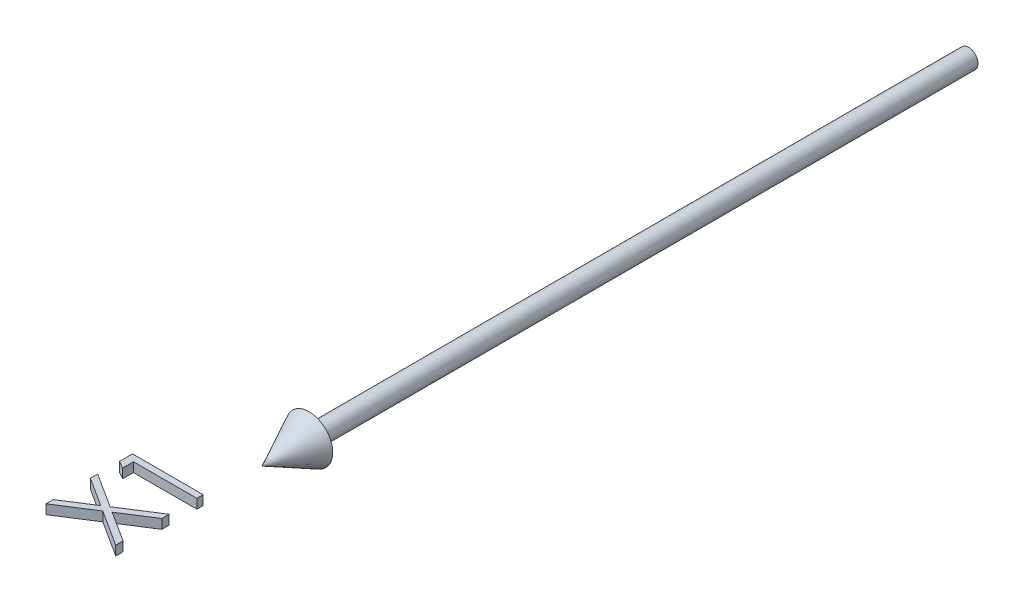
ISO-10303-21;
HEADER;
FILE_DESCRIPTION(('STEP AP214'),'2;1');
FILE_NAME('part.step','',(''),(''),'','','');
FILE_SCHEMA(('AUTOMOTIVE_DESIGN { 1 0 10303 214 1 1 1 1 }'));
ENDSEC;
DATA;
#1=APPLICATION_CONTEXT('core data for automotive mechanical design processes');
#2=APPLICATION_PROTOCOL_DEFINITION('international standard','automotive_design',2000,#1);
#3=PRODUCT_CONTEXT('',#1,'mechanical');
#4=PRODUCT('Part','Part','',(#3));
#5=PRODUCT_RELATED_PRODUCT_CATEGORY('part','',(#4));
#6=PRODUCT_DEFINITION_FORMATION('','',#4);
#7=PRODUCT_DEFINITION_CONTEXT('part definition',#1,'design');
#8=PRODUCT_DEFINITION('design','',#6,#7);
#9=PRODUCT_DEFINITION_SHAPE('','',#8);
#10=(LENGTH_UNIT() NAMED_UNIT(*) SI_UNIT(.MILLI.,.METRE.));
#11=(NAMED_UNIT(*) PLANE_ANGLE_UNIT() SI_UNIT($,.RADIAN.));
#12=(NAMED_UNIT(*) SI_UNIT($,.STERADIAN.) SOLID_ANGLE_UNIT());
#13=UNCERTAINTY_MEASURE_WITH_UNIT(LENGTH_MEASURE(1.E-05),#10,'distance_accuracy_value','');
#14=(GEOMETRIC_REPRESENTATION_CONTEXT(3) GLOBAL_UNCERTAINTY_ASSIGNED_CONTEXT((#13)) GLOBAL_UNIT_ASSIGNED_CONTEXT((#10,
#11,#12)) REPRESENTATION_CONTEXT('',''));
#15=CARTESIAN_POINT('',(0.,0.,0.));
#16=DIRECTION('',(0.,0.,1.));
#17=DIRECTION('',(1.,0.,0.));
#18=AXIS2_PLACEMENT_3D('',#15,#16,#17);
#19=CARTESIAN_POINT('',(-7.65024038461539,1.,176.159855769231));
#20=DIRECTION('',(0.539190475611023,0.,0.842183846324755));
#21=DIRECTION('',(0.842183846324755,0.,-0.539190475611023));
#22=AXIS2_PLACEMENT_3D('',#19,#20,#21);
#23=PLANE('',#22);
#24=DIRECTION('',(0.,-1.,0.));
#25=VECTOR('',#24,1.);
#26=CARTESIAN_POINT('',(-15.,1.,180.865384615385));
#27=LINE('',#26,#25);
#28=CARTESIAN_POINT('',(-15.,1.,180.865384615385));
#29=VERTEX_POINT('',#28);
#30=CARTESIAN_POINT('',(-15.,-1.,180.865384615385));
#31=VERTEX_POINT('',#30);
#32=EDGE_CURVE('E49',#29,#31,#27,.T.);
#33=ORIENTED_EDGE('',*,*,#32,.T.);
#34=DIRECTION('',(-0.842183846324755,0.,0.539190475611023));
#35=VECTOR('',#34,1.);
#36=CARTESIAN_POINT('',(-7.65024038461539,-1.,176.159855769231));
#37=LINE('',#36,#35);
#38=CARTESIAN_POINT('',(-7.65024038461539,-1.,176.159855769231));
#39=VERTEX_POINT('',#38);
#40=EDGE_CURVE('E134',#39,#31,#37,.T.);
#41=ORIENTED_EDGE('',*,*,#40,.F.);
#42=DIRECTION('',(0.,-1.,0.));
#43=VECTOR('',#42,1.);
#44=CARTESIAN_POINT('',(-7.65024038461539,1.,176.159855769231));
#45=LINE('',#44,#43);
#46=CARTESIAN_POINT('',(-7.65024038461539,1.,176.159855769231));
#47=VERTEX_POINT('',#46);
#48=EDGE_CURVE('E12',#47,#39,#45,.T.);
#49=ORIENTED_EDGE('',*,*,#48,.F.);
#50=DIRECTION('',(-0.842183846324755,0.,0.539190475611023));
#51=VECTOR('',#50,1.);
#52=CARTESIAN_POINT('',(-7.65024038461539,1.,176.159855769231));
#53=LINE('',#52,#51);
#54=EDGE_CURVE('E135',#47,#29,#53,.T.);
#55=ORIENTED_EDGE('',*,*,#54,.T.);
#56=EDGE_LOOP('',(#33,#41,#49,#55));
#57=FACE_BOUND('',#56,.T.);
#58=ADVANCED_FACE('F46',(#57),#23,.T.);
#59=CARTESIAN_POINT('',(0.,1.,181.057692307692));
#60=DIRECTION('',(-0.539185104098949,0.,0.842187285298113));
#61=DIRECTION('',(0.842187285298113,0.,0.539185104098949));
#62=AXIS2_PLACEMENT_3D('',#59,#60,#61);
#63=PLANE('',#62);
#64=ORIENTED_EDGE('',*,*,#48,.T.);
#65=DIRECTION('',(-0.842187285298113,0.,-0.539185104098949));
#66=VECTOR('',#65,1.);
#67=CARTESIAN_POINT('',(0.,-1.,181.057692307692));
#68=LINE('',#67,#66);
#69=CARTESIAN_POINT('',(0.,-1.,181.057692307692));
#70=VERTEX_POINT('',#69);
#71=EDGE_CURVE('E152',#70,#39,#68,.T.);
#72=ORIENTED_EDGE('',*,*,#71,.F.);
#73=DIRECTION('',(0.,-1.,0.));
#74=VECTOR('',#73,1.);
#75=CARTESIAN_POINT('',(0.,1.,181.057692307692));
#76=LINE('',#75,#74);
#77=CARTESIAN_POINT('',(0.,1.,181.057692307692));
#78=VERTEX_POINT('',#77);
#79=EDGE_CURVE('E54',#78,#70,#76,.T.);
#80=ORIENTED_EDGE('',*,*,#79,.F.);
#81=DIRECTION('',(-0.842187285298113,0.,-0.539185104098949));
#82=VECTOR('',#81,1.);
#83=CARTESIAN_POINT('',(0.,1.,181.057692307692));
#84=LINE('',#83,#82);
#85=EDGE_CURVE('E140',#78,#47,#84,.T.);
#86=ORIENTED_EDGE('',*,*,#85,.T.);
#87=EDGE_LOOP('',(#64,#72,#80,#86));
#88=FACE_BOUND('',#87,.T.);
#89=ADVANCED_FACE('F264',(#88),#63,.T.);
#90=CARTESIAN_POINT('',(0.,1.,179.504206730769));
#91=DIRECTION('',(1.,0.,0.));
#92=DIRECTION('',(0.,0.,-1.));
#93=AXIS2_PLACEMENT_3D('',#90,#91,#92);
#94=PLANE('',#93);
#95=ORIENTED_EDGE('',*,*,#79,.T.);
#96=DIRECTION('',(0.,0.,1.));
#97=VECTOR('',#96,1.);
#98=CARTESIAN_POINT('',(0.,-1.,179.504206730769));
#99=LINE('',#98,#97);
#100=CARTESIAN_POINT('',(0.,-1.,179.504206730769));
#101=VERTEX_POINT('',#100);
#102=EDGE_CURVE('E177',#101,#70,#99,.T.);
#103=ORIENTED_EDGE('',*,*,#102,.F.);
#104=DIRECTION('',(0.,-1.,0.));
#105=VECTOR('',#104,1.);
#106=CARTESIAN_POINT('',(0.,1.,179.504206730769));
#107=LINE('',#106,#105);
#108=CARTESIAN_POINT('',(0.,1.,179.504206730769));
#109=VERTEX_POINT('',#108);
#110=EDGE_CURVE('E211',#109,#101,#107,.T.);
#111=ORIENTED_EDGE('',*,*,#110,.F.);
#112=DIRECTION('',(0.,0.,1.));
#113=VECTOR('',#112,1.);
#114=CARTESIAN_POINT('',(0.,1.,179.504206730769));
#115=LINE('',#114,#113);
#116=EDGE_CURVE('E207',#109,#78,#115,.T.);
#117=ORIENTED_EDGE('',*,*,#116,.T.);
#118=EDGE_LOOP('',(#95,#103,#111,#117));
#119=FACE_BOUND('',#118,.T.);
#120=ADVANCED_FACE('F262',(#119),#94,.T.);
#121=CARTESIAN_POINT('',(-6.43629807692308,1.,175.384615384615));
#122=DIRECTION('',(0.539087169942496,0.,-0.842249976671648));
#123=DIRECTION('',(-0.842249976671648,0.,-0.539087169942496));
#124=AXIS2_PLACEMENT_3D('',#121,#122,#123);
#125=PLANE('',#124);
#126=ORIENTED_EDGE('',*,*,#110,.T.);
#127=DIRECTION('',(0.842249976671648,0.,0.539087169942496));
#128=VECTOR('',#127,1.);
#129=CARTESIAN_POINT('',(-6.43629807692308,-1.,175.384615384615));
#130=LINE('',#129,#128);
#131=CARTESIAN_POINT('',(-6.43629807692308,-1.,175.384615384615));
#132=VERTEX_POINT('',#131);
#133=EDGE_CURVE('E174',#132,#101,#130,.T.);
#134=ORIENTED_EDGE('',*,*,#133,.F.);
#135=DIRECTION('',(0.,-1.,0.));
#136=VECTOR('',#135,1.);
#137=CARTESIAN_POINT('',(-6.43629807692308,1.,175.384615384615));
#138=LINE('',#137,#136);
#139=CARTESIAN_POINT('',(-6.43629807692308,1.,175.384615384615));
#140=VERTEX_POINT('',#139);
#141=EDGE_CURVE('E213',#140,#132,#138,.T.);
#142=ORIENTED_EDGE('',*,*,#141,.F.);
#143=DIRECTION('',(0.842249976671648,0.,0.539087169942496));
#144=VECTOR('',#143,1.);
#145=CARTESIAN_POINT('',(-6.43629807692308,1.,175.384615384615));
#146=LINE('',#145,#144);
#147=EDGE_CURVE('E204',#140,#109,#146,.T.);
#148=ORIENTED_EDGE('',*,*,#147,.T.);
#149=EDGE_LOOP('',(#126,#134,#142,#148));
#150=FACE_BOUND('',#149,.T.);
#151=ADVANCED_FACE('F260',(#150),#125,.T.);
#152=CARTESIAN_POINT('',(0.,1.,171.265024038462));
#153=DIRECTION('',(0.539087169942498,0.,0.842249976671646));
#154=DIRECTION('',(0.842249976671646,0.,-0.539087169942498));
#155=AXIS2_PLACEMENT_3D('',#152,#153,#154);
#156=PLANE('',#155);
#157=ORIENTED_EDGE('',*,*,#141,.T.);
#158=DIRECTION('',(-0.842249976671646,0.,0.539087169942498));
#159=VECTOR('',#158,1.);
#160=CARTESIAN_POINT('',(0.,-1.,171.265024038462));
#161=LINE('',#160,#159);
#162=CARTESIAN_POINT('',(0.,-1.,171.265024038462));
#163=VERTEX_POINT('',#162);
#164=EDGE_CURVE('E171',#163,#132,#161,.T.);
#165=ORIENTED_EDGE('',*,*,#164,.F.);
#166=DIRECTION('',(0.,-1.,0.));
#167=VECTOR('',#166,1.);
#168=CARTESIAN_POINT('',(0.,1.,171.265024038462));
#169=LINE('',#168,#167);
#170=CARTESIAN_POINT('',(0.,1.,171.265024038462));
#171=VERTEX_POINT('',#170);
#172=EDGE_CURVE('E215',#171,#163,#169,.T.);
#173=ORIENTED_EDGE('',*,*,#172,.F.);
#174=DIRECTION('',(-0.842249976671646,0.,0.539087169942498));
#175=VECTOR('',#174,1.);
#176=CARTESIAN_POINT('',(0.,1.,171.265024038462));
#177=LINE('',#176,#175);
#178=EDGE_CURVE('E201',#171,#140,#177,.T.);
#179=ORIENTED_EDGE('',*,*,#178,.T.);
#180=EDGE_LOOP('',(#157,#165,#173,#179));
#181=FACE_BOUND('',#180,.T.);
#182=ADVANCED_FACE('F255',(#181),#156,.T.);
#183=CARTESIAN_POINT('',(0.,1.,169.711538461538));
#184=DIRECTION('',(1.,0.,0.));
#185=DIRECTION('',(0.,0.,-1.));
#186=AXIS2_PLACEMENT_3D('',#183,#184,#185);
#187=PLANE('',#186);
#188=ORIENTED_EDGE('',*,*,#172,.T.);
#189=DIRECTION('',(0.,0.,1.));
#190=VECTOR('',#189,1.);
#191=CARTESIAN_POINT('',(0.,-1.,169.711538461538));
#192=LINE('',#191,#190);
#193=CARTESIAN_POINT('',(0.,-1.,169.711538461538));
#194=VERTEX_POINT('',#193);
#195=EDGE_CURVE('E168',#194,#163,#192,.T.);
#196=ORIENTED_EDGE('',*,*,#195,.F.);
#197=DIRECTION('',(0.,-1.,0.));
#198=VECTOR('',#197,1.);
#199=CARTESIAN_POINT('',(0.,1.,169.711538461538));
#200=LINE('',#199,#198);
#201=CARTESIAN_POINT('',(0.,1.,169.711538461538));
#202=VERTEX_POINT('',#201);
#203=EDGE_CURVE('E217',#202,#194,#200,.T.);
#204=ORIENTED_EDGE('',*,*,#203,.F.);
#205=DIRECTION('',(0.,0.,1.));
#206=VECTOR('',#205,1.);
#207=CARTESIAN_POINT('',(0.,1.,169.711538461538));
#208=LINE('',#207,#206);
#209=EDGE_CURVE('E198',#202,#171,#208,.T.);
#210=ORIENTED_EDGE('',*,*,#209,.T.);
#211=EDGE_LOOP('',(#188,#196,#204,#210));
#212=FACE_BOUND('',#211,.T.);
#213=ADVANCED_FACE('F250',(#212),#187,.T.);
#214=CARTESIAN_POINT('',(-7.65024038461539,1.,174.606370192308));
#215=DIRECTION('',(-0.538950419912938,0.,-0.842337488703707));
#216=DIRECTION('',(-0.842337488703707,0.,0.538950419912938));
#217=AXIS2_PLACEMENT_3D('',#214,#215,#216);
#218=PLANE('',#217);
#219=ORIENTED_EDGE('',*,*,#203,.T.);
#220=DIRECTION('',(0.842337488703707,0.,-0.538950419912938));
#221=VECTOR('',#220,1.);
#222=CARTESIAN_POINT('',(-7.65024038461539,-1.,174.606370192308));
#223=LINE('',#222,#221);
#224=CARTESIAN_POINT('',(-7.65024038461539,-1.,174.606370192308));
#225=VERTEX_POINT('',#224);
#226=EDGE_CURVE('E165',#225,#194,#223,.T.);
#227=ORIENTED_EDGE('',*,*,#226,.F.);
#228=DIRECTION('',(0.,-1.,0.));
#229=VECTOR('',#228,1.);
#230=CARTESIAN_POINT('',(-7.65024038461539,1.,174.606370192308));
#231=LINE('',#230,#229);
#232=CARTESIAN_POINT('',(-7.65024038461539,1.,174.606370192308));
#233=VERTEX_POINT('',#232);
#234=EDGE_CURVE('E219',#233,#225,#231,.T.);
#235=ORIENTED_EDGE('',*,*,#234,.F.);
#236=DIRECTION('',(0.842337488703707,0.,-0.538950419912938));
#237=VECTOR('',#236,1.);
#238=CARTESIAN_POINT('',(-7.65024038461539,1.,174.606370192308));
#239=LINE('',#238,#237);
#240=EDGE_CURVE('E195',#233,#202,#239,.T.);
#241=ORIENTED_EDGE('',*,*,#240,.T.);
#242=EDGE_LOOP('',(#219,#227,#235,#241));
#243=FACE_BOUND('',#242,.T.);
#244=ADVANCED_FACE('F248',(#243),#218,.T.);
#245=CARTESIAN_POINT('',(-15.,1.,169.903846153846));
#246=DIRECTION('',(0.538946197134425,0.,-0.842340190537257));
#247=DIRECTION('',(-0.842340190537257,0.,-0.538946197134425));
#248=AXIS2_PLACEMENT_3D('',#245,#246,#247);
#249=PLANE('',#248);
#250=ORIENTED_EDGE('',*,*,#234,.T.);
#251=DIRECTION('',(0.842340190537257,0.,0.538946197134425));
#252=VECTOR('',#251,1.);
#253=CARTESIAN_POINT('',(-15.,-1.,169.903846153846));
#254=LINE('',#253,#252);
#255=CARTESIAN_POINT('',(-15.,-1.,169.903846153846));
#256=VERTEX_POINT('',#255);
#257=EDGE_CURVE('E162',#256,#225,#254,.T.);
#258=ORIENTED_EDGE('',*,*,#257,.F.);
#259=DIRECTION('',(0.,-1.,0.));
#260=VECTOR('',#259,1.);
#261=CARTESIAN_POINT('',(-15.,1.,169.903846153846));
#262=LINE('',#261,#260);
#263=CARTESIAN_POINT('',(-15.,1.,169.903846153846));
#264=VERTEX_POINT('',#263);
#265=EDGE_CURVE('E221',#264,#256,#262,.T.);
#266=ORIENTED_EDGE('',*,*,#265,.F.);
#267=DIRECTION('',(0.842340190537257,0.,0.538946197134425));
#268=VECTOR('',#267,1.);
#269=CARTESIAN_POINT('',(-15.,1.,169.903846153846));
#270=LINE('',#269,#268);
#271=EDGE_CURVE('E192',#264,#233,#270,.T.);
#272=ORIENTED_EDGE('',*,*,#271,.T.);
#273=EDGE_LOOP('',(#250,#258,#266,#272));
#274=FACE_BOUND('',#273,.T.);
#275=ADVANCED_FACE('F243',(#274),#249,.T.);
#276=CARTESIAN_POINT('',(-15.,1.,171.457331730769));
#277=DIRECTION('',(-1.,0.,0.));
#278=DIRECTION('',(0.,0.,1.));
#279=AXIS2_PLACEMENT_3D('',#276,#277,#278);
#280=PLANE('',#279);
#281=ORIENTED_EDGE('',*,*,#265,.T.);
#282=DIRECTION('',(0.,0.,-1.));
#283=VECTOR('',#282,1.);
#284=CARTESIAN_POINT('',(-15.,-1.,171.457331730769));
#285=LINE('',#284,#283);
#286=CARTESIAN_POINT('',(-15.,-1.,171.457331730769));
#287=VERTEX_POINT('',#286);
#288=EDGE_CURVE('E159',#287,#256,#285,.T.);
#289=ORIENTED_EDGE('',*,*,#288,.F.);
#290=DIRECTION('',(0.,-1.,0.));
#291=VECTOR('',#290,1.);
#292=CARTESIAN_POINT('',(-15.,1.,171.457331730769));
#293=LINE('',#292,#291);
#294=CARTESIAN_POINT('',(-15.,1.,171.457331730769));
#295=VERTEX_POINT('',#294);
#296=EDGE_CURVE('E223',#295,#287,#293,.T.);
#297=ORIENTED_EDGE('',*,*,#296,.F.);
#298=DIRECTION('',(0.,0.,-1.));
#299=VECTOR('',#298,1.);
#300=CARTESIAN_POINT('',(-15.,1.,171.457331730769));
#301=LINE('',#300,#299);
#302=EDGE_CURVE('E189',#295,#264,#301,.T.);
#303=ORIENTED_EDGE('',*,*,#302,.T.);
#304=EDGE_LOOP('',(#281,#289,#297,#303));
#305=FACE_BOUND('',#304,.T.);
#306=ADVANCED_FACE('F236',(#305),#280,.T.);
#307=CARTESIAN_POINT('',(-8.86418269230769,1.,175.384615384615));
#308=DIRECTION('',(-0.539088809128563,0.,0.842248927498485));
#309=DIRECTION('',(0.842248927498485,0.,0.539088809128563));
#310=AXIS2_PLACEMENT_3D('',#307,#308,#309);
#311=PLANE('',#310);
#312=ORIENTED_EDGE('',*,*,#296,.T.);
#313=DIRECTION('',(-0.842248927498485,0.,-0.539088809128563));
#314=VECTOR('',#313,1.);
#315=CARTESIAN_POINT('',(-8.86418269230769,-1.,175.384615384615));
#316=LINE('',#315,#314);
#317=CARTESIAN_POINT('',(-8.86418269230769,-1.,175.384615384615));
#318=VERTEX_POINT('',#317);
#319=EDGE_CURVE('E156',#318,#287,#316,.T.);
#320=ORIENTED_EDGE('',*,*,#319,.F.);
#321=DIRECTION('',(0.,-1.,0.));
#322=VECTOR('',#321,1.);
#323=CARTESIAN_POINT('',(-8.86418269230769,1.,175.384615384615));
#324=LINE('',#323,#322);
#325=CARTESIAN_POINT('',(-8.86418269230769,1.,175.384615384615));
#326=VERTEX_POINT('',#325);
#327=EDGE_CURVE('E225',#326,#318,#324,.T.);
#328=ORIENTED_EDGE('',*,*,#327,.F.);
#329=DIRECTION('',(-0.842248927498485,0.,-0.539088809128563));
#330=VECTOR('',#329,1.);
#331=CARTESIAN_POINT('',(-8.86418269230769,1.,175.384615384615));
#332=LINE('',#331,#330);
#333=EDGE_CURVE('E186',#326,#295,#332,.T.);
#334=ORIENTED_EDGE('',*,*,#333,.T.);
#335=EDGE_LOOP('',(#312,#320,#328,#334));
#336=FACE_BOUND('',#335,.T.);
#337=ADVANCED_FACE('F233',(#336),#311,.T.);
#338=CARTESIAN_POINT('',(-15.,1.,179.311899038462));
#339=DIRECTION('',(-0.53908880912856,0.,-0.842248927498487));
#340=DIRECTION('',(-0.842248927498487,0.,0.53908880912856));
#341=AXIS2_PLACEMENT_3D('',#338,#339,#340);
#342=PLANE('',#341);
#343=ORIENTED_EDGE('',*,*,#327,.T.);
#344=DIRECTION('',(0.842248927498486,0.,-0.53908880912856));
#345=VECTOR('',#344,1.);
#346=CARTESIAN_POINT('',(-15.,-1.,179.311899038462));
#347=LINE('',#346,#345);
#348=CARTESIAN_POINT('',(-15.,-1.,179.311899038462));
#349=VERTEX_POINT('',#348);
#350=EDGE_CURVE('E147',#349,#318,#347,.T.);
#351=ORIENTED_EDGE('',*,*,#350,.F.);
#352=DIRECTION('',(0.,-1.,0.));
#353=VECTOR('',#352,1.);
#354=CARTESIAN_POINT('',(-15.,1.,179.311899038462));
#355=LINE('',#354,#353);
#356=CARTESIAN_POINT('',(-15.,1.,179.311899038462));
#357=VERTEX_POINT('',#356);
#358=EDGE_CURVE('E139',#357,#349,#355,.T.);
#359=ORIENTED_EDGE('',*,*,#358,.F.);
#360=DIRECTION('',(0.842248927498486,0.,-0.53908880912856));
#361=VECTOR('',#360,1.);
#362=CARTESIAN_POINT('',(-15.,1.,179.311899038462));
#363=LINE('',#362,#361);
#364=EDGE_CURVE('E183',#357,#326,#363,.T.);
#365=ORIENTED_EDGE('',*,*,#364,.T.);
#366=EDGE_LOOP('',(#343,#351,#359,#365));
#367=FACE_BOUND('',#366,.T.);
#368=ADVANCED_FACE('F227',(#367),#342,.T.);
#369=CARTESIAN_POINT('',(-15.,1.,180.865384615385));
#370=DIRECTION('',(-1.,0.,0.));
#371=DIRECTION('',(0.,0.,1.));
#372=AXIS2_PLACEMENT_3D('',#369,#370,#371);
#373=PLANE('',#372);
#374=ORIENTED_EDGE('',*,*,#358,.T.);
#375=DIRECTION('',(0.,0.,-1.));
#376=VECTOR('',#375,1.);
#377=CARTESIAN_POINT('',(-15.,-1.,180.865384615385));
#378=LINE('',#377,#376);
#379=EDGE_CURVE('E142',#31,#349,#378,.T.);
#380=ORIENTED_EDGE('',*,*,#379,.F.);
#381=ORIENTED_EDGE('',*,*,#32,.F.);
#382=DIRECTION('',(0.,0.,-1.));
#383=VECTOR('',#382,1.);
#384=CARTESIAN_POINT('',(-15.,1.,180.865384615385));
#385=LINE('',#384,#383);
#386=EDGE_CURVE('E181',#29,#357,#385,.T.);
#387=ORIENTED_EDGE('',*,*,#386,.T.);
#388=EDGE_LOOP('',(#374,#380,#381,#387));
#389=FACE_BOUND('',#388,.T.);
#390=ADVANCED_FACE('F143',(#389),#373,.T.);
#391=CARTESIAN_POINT('',(0.,1.,0.));
#392=DIRECTION('',(0.,-1.,0.));
#393=DIRECTION('',(0.,0.,-1.));
#394=AXIS2_PLACEMENT_3D('',#391,#392,#393);
#395=PLANE('',#394);
#396=ORIENTED_EDGE('',*,*,#54,.F.);
#397=ORIENTED_EDGE('',*,*,#85,.F.);
#398=ORIENTED_EDGE('',*,*,#116,.F.);
#399=ORIENTED_EDGE('',*,*,#147,.F.);
#400=ORIENTED_EDGE('',*,*,#178,.F.);
#401=ORIENTED_EDGE('',*,*,#209,.F.);
#402=ORIENTED_EDGE('',*,*,#240,.F.);
#403=ORIENTED_EDGE('',*,*,#271,.F.);
#404=ORIENTED_EDGE('',*,*,#302,.F.);
#405=ORIENTED_EDGE('',*,*,#333,.F.);
#406=ORIENTED_EDGE('',*,*,#364,.F.);
#407=ORIENTED_EDGE('',*,*,#386,.F.);
#408=EDGE_LOOP('',(#396,#397,#398,#399,#400,#401,#402,#403,#404,#405,#406,#407));
#409=FACE_BOUND('',#408,.T.);
#410=ADVANCED_FACE('F239',(#409),#395,.F.);
#411=CARTESIAN_POINT('',(0.,-1.,0.));
#412=DIRECTION('',(0.,-1.,0.));
#413=DIRECTION('',(0.,0.,-1.));
#414=AXIS2_PLACEMENT_3D('',#411,#412,#413);
#415=PLANE('',#414);
#416=ORIENTED_EDGE('',*,*,#40,.T.);
#417=ORIENTED_EDGE('',*,*,#379,.T.);
#418=ORIENTED_EDGE('',*,*,#350,.T.);
#419=ORIENTED_EDGE('',*,*,#319,.T.);
#420=ORIENTED_EDGE('',*,*,#288,.T.);
#421=ORIENTED_EDGE('',*,*,#257,.T.);
#422=ORIENTED_EDGE('',*,*,#226,.T.);
#423=ORIENTED_EDGE('',*,*,#195,.T.);
#424=ORIENTED_EDGE('',*,*,#164,.T.);
#425=ORIENTED_EDGE('',*,*,#133,.T.);
#426=ORIENTED_EDGE('',*,*,#102,.T.);
#427=ORIENTED_EDGE('',*,*,#71,.T.);
#428=EDGE_LOOP('',(#416,#417,#418,#419,#420,#421,#422,#423,#424,#425,#426,#427));
#429=FACE_BOUND('',#428,.T.);
#430=ADVANCED_FACE('F150',(#429),#415,.T.);
#431=CLOSED_SHELL('',(#58,#89,#120,#151,#182,#213,#244,#275,#306,#337,#368,#390,#410,#430));
#432=MANIFOLD_SOLID_BREP('B2',#431);
#433=CARTESIAN_POINT('',(-13.4615384615385,1.,166.153846153846));
#434=DIRECTION('',(-0.496686511837692,0.,0.867930013859704));
#435=DIRECTION('',(0.867930013859704,0.,0.496686511837692));
#436=AXIS2_PLACEMENT_3D('',#433,#434,#435);
#437=PLANE('',#436);
#438=DIRECTION('',(0.,-1.,0.));
#439=VECTOR('',#438,1.);
#440=CARTESIAN_POINT('',(-15.,1.,165.2734375));
#441=LINE('',#440,#439);
#442=CARTESIAN_POINT('',(-15.,1.,165.2734375));
#443=VERTEX_POINT('',#442);
#444=CARTESIAN_POINT('',(-15.,-1.,165.2734375));
#445=VERTEX_POINT('',#444);
#446=EDGE_CURVE('E396',#443,#445,#441,.T.);
#447=ORIENTED_EDGE('',*,*,#446,.T.);
#448=DIRECTION('',(-0.867930013859704,0.,-0.496686511837692));
#449=VECTOR('',#448,1.);
#450=CARTESIAN_POINT('',(-13.4615384615385,-1.,166.153846153846));
#451=LINE('',#450,#449);
#452=CARTESIAN_POINT('',(-13.4615384615385,-1.,166.153846153846));
#453=VERTEX_POINT('',#452);
#454=EDGE_CURVE('E445',#453,#445,#451,.T.);
#455=ORIENTED_EDGE('',*,*,#454,.F.);
#456=DIRECTION('',(0.,-1.,0.));
#457=VECTOR('',#456,1.);
#458=CARTESIAN_POINT('',(-13.4615384615385,1.,166.153846153846));
#459=LINE('',#458,#457);
#460=CARTESIAN_POINT('',(-13.4615384615385,1.,166.153846153846));
#461=VERTEX_POINT('',#460);
#462=EDGE_CURVE('E44',#461,#453,#459,.T.);
#463=ORIENTED_EDGE('',*,*,#462,.F.);
#464=DIRECTION('',(-0.867930013859704,0.,-0.496686511837692));
#465=VECTOR('',#464,1.);
#466=CARTESIAN_POINT('',(-13.4615384615385,1.,166.153846153846));
#467=LINE('',#466,#465);
#468=EDGE_CURVE('E446',#461,#443,#467,.T.);
#469=ORIENTED_EDGE('',*,*,#468,.T.);
#470=EDGE_LOOP('',(#447,#455,#463,#469));
#471=FACE_BOUND('',#470,.T.);
#472=ADVANCED_FACE('F393',(#471),#437,.T.);
#473=CARTESIAN_POINT('',(-13.4615384615385,1.,163.846153846154));
#474=DIRECTION('',(1.,0.,0.));
#475=DIRECTION('',(0.,0.,-1.));
#476=AXIS2_PLACEMENT_3D('',#473,#474,#475);
#477=PLANE('',#476);
#478=ORIENTED_EDGE('',*,*,#462,.T.);
#479=DIRECTION('',(0.,0.,1.));
#480=VECTOR('',#479,1.);
#481=CARTESIAN_POINT('',(-13.4615384615385,-1.,163.846153846154));
#482=LINE('',#481,#480);
#483=CARTESIAN_POINT('',(-13.4615384615385,-1.,163.846153846154));
#484=VERTEX_POINT('',#483);
#485=EDGE_CURVE('E463',#484,#453,#482,.T.);
#486=ORIENTED_EDGE('',*,*,#485,.F.);
#487=DIRECTION('',(0.,-1.,0.));
#488=VECTOR('',#487,1.);
#489=CARTESIAN_POINT('',(-13.4615384615385,1.,163.846153846154));
#490=LINE('',#489,#488);
#491=CARTESIAN_POINT('',(-13.4615384615385,1.,163.846153846154));
#492=VERTEX_POINT('',#491);
#493=EDGE_CURVE('E401',#492,#484,#490,.T.);
#494=ORIENTED_EDGE('',*,*,#493,.F.);
#495=DIRECTION('',(0.,0.,1.));
#496=VECTOR('',#495,1.);
#497=CARTESIAN_POINT('',(-13.4615384615385,1.,163.846153846154));
#498=LINE('',#497,#496);
#499=EDGE_CURVE('E451',#492,#461,#498,.T.);
#500=ORIENTED_EDGE('',*,*,#499,.T.);
#501=EDGE_LOOP('',(#478,#486,#494,#500));
#502=FACE_BOUND('',#501,.T.);
#503=ADVANCED_FACE('F503',(#502),#477,.T.);
#504=CARTESIAN_POINT('',(0.,1.,163.846153846154));
#505=DIRECTION('',(0.,0.,1.));
#506=DIRECTION('',(1.,0.,0.));
#507=AXIS2_PLACEMENT_3D('',#504,#505,#506);
#508=PLANE('',#507);
#509=ORIENTED_EDGE('',*,*,#493,.T.);
#510=DIRECTION('',(-1.,0.,0.));
#511=VECTOR('',#510,1.);
#512=CARTESIAN_POINT('',(0.,-1.,163.846153846154));
#513=LINE('',#512,#511);
#514=CARTESIAN_POINT('',(0.,-1.,163.846153846154));
#515=VERTEX_POINT('',#514);
#516=EDGE_CURVE('E470',#515,#484,#513,.T.);
#517=ORIENTED_EDGE('',*,*,#516,.F.);
#518=DIRECTION('',(0.,-1.,0.));
#519=VECTOR('',#518,1.);
#520=CARTESIAN_POINT('',(0.,1.,163.846153846154));
#521=LINE('',#520,#519);
#522=CARTESIAN_POINT('',(0.,1.,163.846153846154));
#523=VERTEX_POINT('',#522);
#524=EDGE_CURVE('E486',#523,#515,#521,.T.);
#525=ORIENTED_EDGE('',*,*,#524,.F.);
#526=DIRECTION('',(-1.,0.,0.));
#527=VECTOR('',#526,1.);
#528=CARTESIAN_POINT('',(0.,1.,163.846153846154));
#529=LINE('',#528,#527);
#530=EDGE_CURVE('E482',#523,#492,#529,.T.);
#531=ORIENTED_EDGE('',*,*,#530,.T.);
#532=EDGE_LOOP('',(#509,#517,#525,#531));
#533=FACE_BOUND('',#532,.T.);
#534=ADVANCED_FACE('F499',(#533),#508,.T.);
#535=CARTESIAN_POINT('',(0.,1.,162.5));
#536=DIRECTION('',(1.,0.,0.));
#537=DIRECTION('',(0.,0.,-1.));
#538=AXIS2_PLACEMENT_3D('',#535,#536,#537);
#539=PLANE('',#538);
#540=ORIENTED_EDGE('',*,*,#524,.T.);
#541=DIRECTION('',(0.,0.,1.));
#542=VECTOR('',#541,1.);
#543=CARTESIAN_POINT('',(0.,-1.,162.5));
#544=LINE('',#543,#542);
#545=CARTESIAN_POINT('',(0.,-1.,162.5));
#546=VERTEX_POINT('',#545);
#547=EDGE_CURVE('E467',#546,#515,#544,.T.);
#548=ORIENTED_EDGE('',*,*,#547,.F.);
#549=DIRECTION('',(0.,-1.,0.));
#550=VECTOR('',#549,1.);
#551=CARTESIAN_POINT('',(0.,1.,162.5));
#552=LINE('',#551,#550);
#553=CARTESIAN_POINT('',(0.,1.,162.5));
#554=VERTEX_POINT('',#553);
#555=EDGE_CURVE('E488',#554,#546,#552,.T.);
#556=ORIENTED_EDGE('',*,*,#555,.F.);
#557=DIRECTION('',(0.,0.,1.));
#558=VECTOR('',#557,1.);
#559=CARTESIAN_POINT('',(0.,1.,162.5));
#560=LINE('',#559,#558);
#561=EDGE_CURVE('E479',#554,#523,#560,.T.);
#562=ORIENTED_EDGE('',*,*,#561,.T.);
#563=EDGE_LOOP('',(#540,#548,#556,#562));
#564=FACE_BOUND('',#563,.T.);
#565=ADVANCED_FACE('F496',(#564),#539,.T.);
#566=CARTESIAN_POINT('',(-15.,1.,162.5));
#567=DIRECTION('',(0.,0.,-1.));
#568=DIRECTION('',(-1.,0.,0.));
#569=AXIS2_PLACEMENT_3D('',#566,#567,#568);
#570=PLANE('',#569);
#571=ORIENTED_EDGE('',*,*,#555,.T.);
#572=DIRECTION('',(1.,0.,0.));
#573=VECTOR('',#572,1.);
#574=CARTESIAN_POINT('',(-15.,-1.,162.5));
#575=LINE('',#574,#573);
#576=CARTESIAN_POINT('',(-15.,-1.,162.5));
#577=VERTEX_POINT('',#576);
#578=EDGE_CURVE('E458',#577,#546,#575,.T.);
#579=ORIENTED_EDGE('',*,*,#578,.F.);
#580=DIRECTION('',(0.,-1.,0.));
#581=VECTOR('',#580,1.);
#582=CARTESIAN_POINT('',(-15.,1.,162.5));
#583=LINE('',#582,#581);
#584=CARTESIAN_POINT('',(-15.,1.,162.5));
#585=VERTEX_POINT('',#584);
#586=EDGE_CURVE('E450',#585,#577,#583,.T.);
#587=ORIENTED_EDGE('',*,*,#586,.F.);
#588=DIRECTION('',(1.,0.,0.));
#589=VECTOR('',#588,1.);
#590=CARTESIAN_POINT('',(-15.,1.,162.5));
#591=LINE('',#590,#589);
#592=EDGE_CURVE('E476',#585,#554,#591,.T.);
#593=ORIENTED_EDGE('',*,*,#592,.T.);
#594=EDGE_LOOP('',(#571,#579,#587,#593));
#595=FACE_BOUND('',#594,.T.);
#596=ADVANCED_FACE('F490',(#595),#570,.T.);
#597=CARTESIAN_POINT('',(-15.,1.,165.2734375));
#598=DIRECTION('',(-1.,0.,0.));
#599=DIRECTION('',(0.,0.,1.));
#600=AXIS2_PLACEMENT_3D('',#597,#598,#599);
#601=PLANE('',#600);
#602=ORIENTED_EDGE('',*,*,#586,.T.);
#603=DIRECTION('',(0.,0.,-1.));
#604=VECTOR('',#603,1.);
#605=CARTESIAN_POINT('',(-15.,-1.,165.2734375));
#606=LINE('',#605,#604);
#607=EDGE_CURVE('E453',#445,#577,#606,.T.);
#608=ORIENTED_EDGE('',*,*,#607,.F.);
#609=ORIENTED_EDGE('',*,*,#446,.F.);
#610=DIRECTION('',(0.,0.,-1.));
#611=VECTOR('',#610,1.);
#612=CARTESIAN_POINT('',(-15.,1.,165.2734375));
#613=LINE('',#612,#611);
#614=EDGE_CURVE('E474',#443,#585,#613,.T.);
#615=ORIENTED_EDGE('',*,*,#614,.T.);
#616=EDGE_LOOP('',(#602,#608,#609,#615));
#617=FACE_BOUND('',#616,.T.);
#618=ADVANCED_FACE('F454',(#617),#601,.T.);
#619=CARTESIAN_POINT('',(0.,1.,0.));
#620=DIRECTION('',(0.,-1.,0.));
#621=DIRECTION('',(0.,0.,-1.));
#622=AXIS2_PLACEMENT_3D('',#619,#620,#621);
#623=PLANE('',#622);
#624=ORIENTED_EDGE('',*,*,#468,.F.);
#625=ORIENTED_EDGE('',*,*,#499,.F.);
#626=ORIENTED_EDGE('',*,*,#530,.F.);
#627=ORIENTED_EDGE('',*,*,#561,.F.);
#628=ORIENTED_EDGE('',*,*,#592,.F.);
#629=ORIENTED_EDGE('',*,*,#614,.F.);
#630=EDGE_LOOP('',(#624,#625,#626,#627,#628,#629));
#631=FACE_BOUND('',#630,.T.);
#632=ADVANCED_FACE('F502',(#631),#623,.F.);
#633=CARTESIAN_POINT('',(0.,-1.,0.));
#634=DIRECTION('',(0.,-1.,0.));
#635=DIRECTION('',(0.,0.,-1.));
#636=AXIS2_PLACEMENT_3D('',#633,#634,#635);
#637=PLANE('',#636);
#638=ORIENTED_EDGE('',*,*,#454,.T.);
#639=ORIENTED_EDGE('',*,*,#607,.T.);
#640=ORIENTED_EDGE('',*,*,#578,.T.);
#641=ORIENTED_EDGE('',*,*,#547,.T.);
#642=ORIENTED_EDGE('',*,*,#516,.T.);
#643=ORIENTED_EDGE('',*,*,#485,.T.);
#644=EDGE_LOOP('',(#638,#639,#640,#641,#642,#643));
#645=FACE_BOUND('',#644,.T.);
#646=ADVANCED_FACE('F461',(#645),#637,.T.);
#647=CLOSED_SHELL('',(#472,#503,#534,#565,#596,#618,#632,#646));
#648=MANIFOLD_SOLID_BREP('B6',#647);
#649=CARTESIAN_POINT('',(2.,0.,0.));
#650=DIRECTION('',(0.,0.,1.));
#651=DIRECTION('',(1.,0.,0.));
#652=AXIS2_PLACEMENT_3D('',#649,#650,#651);
#653=PLANE('',#652);
#654=CARTESIAN_POINT('',(0.,0.,0.));
#655=DIRECTION('',(0.,0.,-1.));
#656=DIRECTION('',(-1.,0.,0.));
#657=AXIS2_PLACEMENT_3D('',#654,#655,#656);
#658=CIRCLE('',#657,2.);
#659=CARTESIAN_POINT('',(-2.,0.,0.));
#660=VERTEX_POINT('',#659);
#661=EDGE_CURVE('E391',#660,#660,#658,.T.);
#662=ORIENTED_EDGE('',*,*,#661,.T.);
#663=EDGE_LOOP('',(#662));
#664=FACE_BOUND('',#663,.T.);
#665=ADVANCED_FACE('F569',(#664),#653,.F.);
#666=CARTESIAN_POINT('',(0.,0.,-41.9499520246458));
#667=DIRECTION('',(0.,0.,-1.));
#668=DIRECTION('',(-1.,0.,0.));
#669=AXIS2_PLACEMENT_3D('',#666,#667,#668);
#670=CYLINDRICAL_SURFACE('',#669,2.);
#671=ORIENTED_EDGE('',*,*,#661,.F.);
#672=EDGE_LOOP('',(#671));
#673=FACE_BOUND('',#672,.T.);
#674=CARTESIAN_POINT('',(0.,0.,140.));
#675=DIRECTION('',(0.,0.,-1.));
#676=DIRECTION('',(-1.,0.,0.));
#677=AXIS2_PLACEMENT_3D('',#674,#675,#676);
#678=CIRCLE('',#677,2.);
#679=CARTESIAN_POINT('',(-2.,0.,140.));
#680=VERTEX_POINT('',#679);
#681=EDGE_CURVE('E575',#680,#680,#678,.T.);
#682=ORIENTED_EDGE('',*,*,#681,.T.);
#683=EDGE_LOOP('',(#682));
#684=FACE_BOUND('',#683,.T.);
#685=ADVANCED_FACE('F586',(#673,#684),#670,.T.);
#686=CARTESIAN_POINT('',(5.00000000000002,0.,140.));
#687=DIRECTION('',(0.,0.,1.));
#688=DIRECTION('',(1.,0.,0.));
#689=AXIS2_PLACEMENT_3D('',#686,#687,#688);
#690=PLANE('',#689);
#691=ORIENTED_EDGE('',*,*,#681,.F.);
#692=EDGE_LOOP('',(#691));
#693=FACE_BOUND('',#692,.T.);
#694=CARTESIAN_POINT('',(0.,0.,140.));
#695=DIRECTION('',(0.,0.,-1.));
#696=DIRECTION('',(-1.,0.,0.));
#697=AXIS2_PLACEMENT_3D('',#694,#695,#696);
#698=CIRCLE('',#697,5.00000000000002);
#699=CARTESIAN_POINT('',(-5.00000000000002,0.,140.));
#700=VERTEX_POINT('',#699);
#701=EDGE_CURVE('E600',#700,#700,#698,.T.);
#702=ORIENTED_EDGE('',*,*,#701,.T.);
#703=EDGE_LOOP('',(#702));
#704=FACE_BOUND('',#703,.T.);
#705=ADVANCED_FACE('F580',(#693,#704),#690,.F.);
#706=CARTESIAN_POINT('',(0.,0.,150.));
#707=DIRECTION('',(0.,0.,-1.));
#708=DIRECTION('',(-1.,0.,0.));
#709=AXIS2_PLACEMENT_3D('',#706,#707,#708);
#710=CONICAL_SURFACE('',#709,0.,0.463647609000806);
#711=ORIENTED_EDGE('',*,*,#701,.F.);
#712=EDGE_LOOP('',(#711));
#713=FACE_BOUND('',#712,.T.);
#714=CARTESIAN_POINT('',(0.,0.,150.));
#715=VERTEX_POINT('',#714);
#716=VERTEX_LOOP('',#715);
#717=FACE_BOUND('',#716,.T.);
#718=ADVANCED_FACE('F578',(#713,#717),#710,.T.);
#719=CLOSED_SHELL('',(#665,#685,#705,#718));
#720=MANIFOLD_SOLID_BREP('B38',#719);
#721=ADVANCED_BREP_SHAPE_REPRESENTATION('',(#18,#432,#648,#720),#14);
#722=SHAPE_DEFINITION_REPRESENTATION(#9,#721);
ENDSEC;
END-ISO-10303-21;
